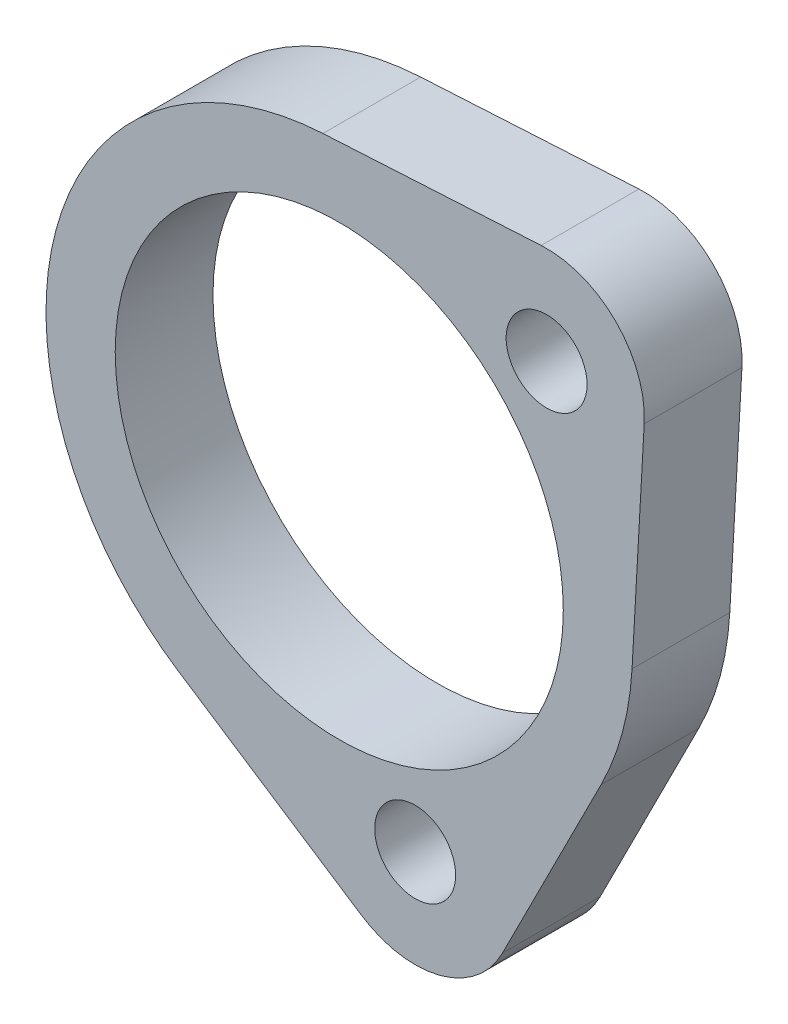
ISO-10303-21;
HEADER;
FILE_DESCRIPTION(('STEP AP214'),'2;1');
FILE_NAME('part.step','',(''),(''),'','','');
FILE_SCHEMA(('AUTOMOTIVE_DESIGN { 1 0 10303 214 1 1 1 1 }'));
ENDSEC;
DATA;
#1=APPLICATION_CONTEXT('core data for automotive mechanical design processes');
#2=APPLICATION_PROTOCOL_DEFINITION('international standard','automotive_design',2000,#1);
#3=PRODUCT_CONTEXT('',#1,'mechanical');
#4=PRODUCT('Part','Part','',(#3));
#5=PRODUCT_RELATED_PRODUCT_CATEGORY('part','',(#4));
#6=PRODUCT_DEFINITION_FORMATION('','',#4);
#7=PRODUCT_DEFINITION_CONTEXT('part definition',#1,'design');
#8=PRODUCT_DEFINITION('design','',#6,#7);
#9=PRODUCT_DEFINITION_SHAPE('','',#8);
#10=(LENGTH_UNIT() NAMED_UNIT(*) SI_UNIT(.MILLI.,.METRE.));
#11=(NAMED_UNIT(*) PLANE_ANGLE_UNIT() SI_UNIT($,.RADIAN.));
#12=(NAMED_UNIT(*) SI_UNIT($,.STERADIAN.) SOLID_ANGLE_UNIT());
#13=UNCERTAINTY_MEASURE_WITH_UNIT(LENGTH_MEASURE(1.E-05),#10,'distance_accuracy_value','');
#14=(GEOMETRIC_REPRESENTATION_CONTEXT(3) GLOBAL_UNCERTAINTY_ASSIGNED_CONTEXT((#13)) GLOBAL_UNIT_ASSIGNED_CONTEXT((#10,
#11,#12)) REPRESENTATION_CONTEXT('',''));
#15=CARTESIAN_POINT('',(0.,0.,0.));
#16=DIRECTION('',(0.,0.,1.));
#17=DIRECTION('',(1.,0.,0.));
#18=AXIS2_PLACEMENT_3D('',#15,#16,#17);
#19=CARTESIAN_POINT('',(13.4703841816036,13.4703841816039,6.35));
#20=DIRECTION('',(0.,0.,1.));
#21=DIRECTION('',(1.,0.,0.));
#22=AXIS2_PLACEMENT_3D('',#19,#20,#21);
#23=PLANE('',#22);
#24=CARTESIAN_POINT('',(4.93050280920324,-18.4008869908067,6.35));
#25=DIRECTION('',(0.,0.,1.));
#26=DIRECTION('',(1.,0.,0.));
#27=AXIS2_PLACEMENT_3D('',#24,#25,#26);
#28=CIRCLE('',#27,2.6289);
#29=CARTESIAN_POINT('',(7.55940280920324,-18.4008869908067,6.35));
#30=VERTEX_POINT('',#29);
#31=EDGE_CURVE('E182',#30,#30,#28,.T.);
#32=ORIENTED_EDGE('',*,*,#31,.F.);
#33=EDGE_LOOP('',(#32));
#34=FACE_BOUND('',#33,.T.);
#35=CARTESIAN_POINT('',(13.4703841816036,13.4703841816039,6.35));
#36=DIRECTION('',(0.,0.,1.));
#37=DIRECTION('',(1.,0.,0.));
#38=AXIS2_PLACEMENT_3D('',#35,#36,#37);
#39=CIRCLE('',#38,6.35);
#40=CARTESIAN_POINT('',(19.8105467456382,13.1170590316154,6.35));
#41=VERTEX_POINT('',#40);
#42=CARTESIAN_POINT('',(13.1170590316151,19.8105467456384,6.35));
#43=VERTEX_POINT('',#42);
#44=EDGE_CURVE('E145',#41,#43,#39,.T.);
#45=ORIENTED_EDGE('',*,*,#44,.T.);
#46=DIRECTION('',(-0.998450797485761,-0.055641755903707,0.));
#47=VECTOR('',#46,1.);
#48=CARTESIAN_POINT('',(-1.05997544996563,19.0204876921038,6.35));
#49=LINE('',#48,#47);
#50=CARTESIAN_POINT('',(-1.05997544996563,19.0204876921037,6.35));
#51=VERTEX_POINT('',#50);
#52=EDGE_CURVE('E93',#43,#51,#49,.T.);
#53=ORIENTED_EDGE('',*,*,#52,.T.);
#54=CARTESIAN_POINT('',(0.,0.,6.35));
#55=DIRECTION('',(0.,0.,1.));
#56=DIRECTION('',(1.,0.,0.));
#57=AXIS2_PLACEMENT_3D('',#54,#55,#56);
#58=CIRCLE('',#57,19.05);
#59=CARTESIAN_POINT('',(-10.4282095131096,-15.9422378087485,6.35));
#60=VERTEX_POINT('',#59);
#61=EDGE_CURVE('E160',#51,#60,#58,.T.);
#62=ORIENTED_EDGE('',*,*,#61,.T.);
#63=DIRECTION('',(0.836862877099659,-0.547412572866646,0.));
#64=VECTOR('',#63,1.);
#65=CARTESIAN_POINT('',(-10.4282095131096,-15.9422378087485,6.35));
#66=LINE('',#65,#64);
#67=CARTESIAN_POINT('',(1.45443297150005,-23.7149662603895,6.35));
#68=VERTEX_POINT('',#67);
#69=EDGE_CURVE('E173',#60,#68,#66,.T.);
#70=ORIENTED_EDGE('',*,*,#69,.T.);
#71=CARTESIAN_POINT('',(4.93050280920324,-18.4008869908067,6.35));
#72=DIRECTION('',(0.,0.,1.));
#73=DIRECTION('',(-1.,0.,0.));
#74=AXIS2_PLACEMENT_3D('',#71,#72,#73);
#75=CIRCLE('',#74,6.34999999999999);
#76=CARTESIAN_POINT('',(10.5979072287745,-21.2649797171379,6.35));
#77=VERTEX_POINT('',#76);
#78=EDGE_CURVE('E112',#68,#77,#75,.T.);
#79=ORIENTED_EDGE('',*,*,#78,.T.);
#80=DIRECTION('',(0.451038224619094,0.892504633003356,0.));
#81=VECTOR('',#80,1.);
#82=CARTESIAN_POINT('',(10.5979072287745,-21.2649797171379,6.35));
#83=LINE('',#82,#81);
#84=CARTESIAN_POINT('',(17.0022132587139,-8.59227817899376,6.35));
#85=VERTEX_POINT('',#84);
#86=EDGE_CURVE('E106',#77,#85,#83,.T.);
#87=ORIENTED_EDGE('',*,*,#86,.T.);
#88=CARTESIAN_POINT('',(0.,0.,6.35));
#89=DIRECTION('',(0.,0.,1.));
#90=DIRECTION('',(1.,0.,0.));
#91=AXIS2_PLACEMENT_3D('',#88,#89,#90);
#92=CIRCLE('',#91,19.05);
#93=CARTESIAN_POINT('',(19.0204876921038,-1.05997544996527,6.35));
#94=VERTEX_POINT('',#93);
#95=EDGE_CURVE('E110',#85,#94,#92,.T.);
#96=ORIENTED_EDGE('',*,*,#95,.T.);
#97=DIRECTION('',(0.0556417559036886,0.998450797485762,0.));
#98=VECTOR('',#97,1.);
#99=CARTESIAN_POINT('',(19.0204876921038,-1.05997544996527,6.35));
#100=LINE('',#99,#98);
#101=EDGE_CURVE('E50',#94,#41,#100,.T.);
#102=ORIENTED_EDGE('',*,*,#101,.T.);
#103=EDGE_LOOP('',(#45,#53,#62,#70,#79,#87,#96,#102));
#104=FACE_BOUND('',#103,.T.);
#105=CARTESIAN_POINT('',(0.,0.,6.35));
#106=DIRECTION('',(0.,0.,1.));
#107=DIRECTION('',(1.,0.,0.));
#108=AXIS2_PLACEMENT_3D('',#105,#106,#107);
#109=CIRCLE('',#108,14.5542);
#110=CARTESIAN_POINT('',(14.5542,0.,6.35));
#111=VERTEX_POINT('',#110);
#112=EDGE_CURVE('E134',#111,#111,#109,.T.);
#113=ORIENTED_EDGE('',*,*,#112,.F.);
#114=EDGE_LOOP('',(#113));
#115=FACE_BOUND('',#114,.T.);
#116=CARTESIAN_POINT('',(13.4703841816036,13.4703841816039,6.35));
#117=DIRECTION('',(0.,0.,1.));
#118=DIRECTION('',(1.,0.,0.));
#119=AXIS2_PLACEMENT_3D('',#116,#117,#118);
#120=CIRCLE('',#119,2.6289);
#121=CARTESIAN_POINT('',(16.0992841816036,13.4703841816039,6.35));
#122=VERTEX_POINT('',#121);
#123=EDGE_CURVE('E188',#122,#122,#120,.T.);
#124=ORIENTED_EDGE('',*,*,#123,.F.);
#125=EDGE_LOOP('',(#124));
#126=FACE_BOUND('',#125,.T.);
#127=ADVANCED_FACE('F33',(#34,#104,#115,#126),#23,.T.);
#128=CARTESIAN_POINT('',(13.4703841816036,13.4703841816039,0.));
#129=DIRECTION('',(0.,0.,1.));
#130=DIRECTION('',(1.,0.,0.));
#131=AXIS2_PLACEMENT_3D('',#128,#129,#130);
#132=PLANE('',#131);
#133=CARTESIAN_POINT('',(13.4703841816036,13.4703841816039,0.));
#134=DIRECTION('',(0.,0.,1.));
#135=DIRECTION('',(1.,0.,0.));
#136=AXIS2_PLACEMENT_3D('',#133,#134,#135);
#137=CIRCLE('',#136,6.35);
#138=CARTESIAN_POINT('',(19.8105467456382,13.1170590316154,0.));
#139=VERTEX_POINT('',#138);
#140=CARTESIAN_POINT('',(13.1170590316151,19.8105467456384,0.));
#141=VERTEX_POINT('',#140);
#142=EDGE_CURVE('E130',#139,#141,#137,.T.);
#143=ORIENTED_EDGE('',*,*,#142,.F.);
#144=DIRECTION('',(0.0556417559036886,0.998450797485762,0.));
#145=VECTOR('',#144,1.);
#146=CARTESIAN_POINT('',(19.0204876921038,-1.05997544996527,0.));
#147=LINE('',#146,#145);
#148=CARTESIAN_POINT('',(19.0204876921038,-1.05997544996527,0.));
#149=VERTEX_POINT('',#148);
#150=EDGE_CURVE('E85',#149,#139,#147,.T.);
#151=ORIENTED_EDGE('',*,*,#150,.F.);
#152=CARTESIAN_POINT('',(0.,0.,0.));
#153=DIRECTION('',(0.,0.,1.));
#154=DIRECTION('',(1.,0.,0.));
#155=AXIS2_PLACEMENT_3D('',#152,#153,#154);
#156=CIRCLE('',#155,19.05);
#157=CARTESIAN_POINT('',(17.0022132587139,-8.59227817899376,0.));
#158=VERTEX_POINT('',#157);
#159=EDGE_CURVE('E79',#158,#149,#156,.T.);
#160=ORIENTED_EDGE('',*,*,#159,.F.);
#161=DIRECTION('',(0.451038224619094,0.892504633003356,0.));
#162=VECTOR('',#161,1.);
#163=CARTESIAN_POINT('',(10.5979072287745,-21.2649797171379,0.));
#164=LINE('',#163,#162);
#165=CARTESIAN_POINT('',(10.5979072287745,-21.2649797171379,0.));
#166=VERTEX_POINT('',#165);
#167=EDGE_CURVE('E120',#166,#158,#164,.T.);
#168=ORIENTED_EDGE('',*,*,#167,.F.);
#169=CARTESIAN_POINT('',(4.93050280920324,-18.4008869908067,0.));
#170=DIRECTION('',(0.,0.,1.));
#171=DIRECTION('',(-1.,0.,0.));
#172=AXIS2_PLACEMENT_3D('',#169,#170,#171);
#173=CIRCLE('',#172,6.34999999999999);
#174=CARTESIAN_POINT('',(1.45443297150005,-23.7149662603895,0.));
#175=VERTEX_POINT('',#174);
#176=EDGE_CURVE('E140',#175,#166,#173,.T.);
#177=ORIENTED_EDGE('',*,*,#176,.F.);
#178=DIRECTION('',(0.836862877099659,-0.547412572866646,0.));
#179=VECTOR('',#178,1.);
#180=CARTESIAN_POINT('',(-10.4282095131096,-15.9422378087485,0.));
#181=LINE('',#180,#179);
#182=CARTESIAN_POINT('',(-10.4282095131096,-15.9422378087485,0.));
#183=VERTEX_POINT('',#182);
#184=EDGE_CURVE('E138',#183,#175,#181,.T.);
#185=ORIENTED_EDGE('',*,*,#184,.F.);
#186=CARTESIAN_POINT('',(0.,0.,0.));
#187=DIRECTION('',(0.,0.,1.));
#188=DIRECTION('',(1.,0.,0.));
#189=AXIS2_PLACEMENT_3D('',#186,#187,#188);
#190=CIRCLE('',#189,19.05);
#191=CARTESIAN_POINT('',(-1.05997544996563,19.0204876921037,0.));
#192=VERTEX_POINT('',#191);
#193=EDGE_CURVE('E136',#192,#183,#190,.T.);
#194=ORIENTED_EDGE('',*,*,#193,.F.);
#195=DIRECTION('',(-0.998450797485761,-0.055641755903707,0.));
#196=VECTOR('',#195,1.);
#197=CARTESIAN_POINT('',(-1.05997544996563,19.0204876921038,0.));
#198=LINE('',#197,#196);
#199=EDGE_CURVE('E133',#141,#192,#198,.T.);
#200=ORIENTED_EDGE('',*,*,#199,.F.);
#201=EDGE_LOOP('',(#143,#151,#160,#168,#177,#185,#194,#200));
#202=FACE_BOUND('',#201,.T.);
#203=CARTESIAN_POINT('',(0.,0.,0.));
#204=DIRECTION('',(0.,0.,1.));
#205=DIRECTION('',(1.,0.,0.));
#206=AXIS2_PLACEMENT_3D('',#203,#204,#205);
#207=CIRCLE('',#206,14.5542);
#208=CARTESIAN_POINT('',(14.5542,0.,0.));
#209=VERTEX_POINT('',#208);
#210=EDGE_CURVE('E179',#209,#209,#207,.T.);
#211=ORIENTED_EDGE('',*,*,#210,.T.);
#212=EDGE_LOOP('',(#211));
#213=FACE_BOUND('',#212,.T.);
#214=CARTESIAN_POINT('',(4.93050280920324,-18.4008869908067,0.));
#215=DIRECTION('',(0.,0.,1.));
#216=DIRECTION('',(1.,0.,0.));
#217=AXIS2_PLACEMENT_3D('',#214,#215,#216);
#218=CIRCLE('',#217,2.6289);
#219=CARTESIAN_POINT('',(7.55940280920324,-18.4008869908067,0.));
#220=VERTEX_POINT('',#219);
#221=EDGE_CURVE('E185',#220,#220,#218,.T.);
#222=ORIENTED_EDGE('',*,*,#221,.T.);
#223=EDGE_LOOP('',(#222));
#224=FACE_BOUND('',#223,.T.);
#225=CARTESIAN_POINT('',(13.4703841816036,13.4703841816039,0.));
#226=DIRECTION('',(0.,0.,1.));
#227=DIRECTION('',(1.,0.,0.));
#228=AXIS2_PLACEMENT_3D('',#225,#226,#227);
#229=CIRCLE('',#228,2.6289);
#230=CARTESIAN_POINT('',(16.0992841816036,13.4703841816039,0.));
#231=VERTEX_POINT('',#230);
#232=EDGE_CURVE('E191',#231,#231,#229,.T.);
#233=ORIENTED_EDGE('',*,*,#232,.T.);
#234=EDGE_LOOP('',(#233));
#235=FACE_BOUND('',#234,.T.);
#236=ADVANCED_FACE('F164',(#202,#213,#224,#235),#132,.F.);
#237=CARTESIAN_POINT('',(13.4703841816036,13.4703841816039,6.35));
#238=DIRECTION('',(0.,0.,-1.));
#239=DIRECTION('',(-1.,0.,0.));
#240=AXIS2_PLACEMENT_3D('',#237,#238,#239);
#241=CYLINDRICAL_SURFACE('',#240,6.35);
#242=ORIENTED_EDGE('',*,*,#142,.T.);
#243=DIRECTION('',(0.,0.,-1.));
#244=VECTOR('',#243,1.);
#245=CARTESIAN_POINT('',(13.1170590316151,19.8105467456384,6.35));
#246=LINE('',#245,#244);
#247=EDGE_CURVE('E11',#43,#141,#246,.T.);
#248=ORIENTED_EDGE('',*,*,#247,.F.);
#249=ORIENTED_EDGE('',*,*,#44,.F.);
#250=DIRECTION('',(0.,0.,-1.));
#251=VECTOR('',#250,1.);
#252=CARTESIAN_POINT('',(19.8105467456382,13.1170590316154,6.35));
#253=LINE('',#252,#251);
#254=EDGE_CURVE('E126',#41,#139,#253,.T.);
#255=ORIENTED_EDGE('',*,*,#254,.T.);
#256=EDGE_LOOP('',(#242,#248,#249,#255));
#257=FACE_BOUND('',#256,.T.);
#258=ADVANCED_FACE('F35',(#257),#241,.T.);
#259=CARTESIAN_POINT('',(-1.05997544996563,19.0204876921038,6.35));
#260=DIRECTION('',(0.055641755903707,-0.998450797485761,0.));
#261=DIRECTION('',(0.998450797485761,0.055641755903707,0.));
#262=AXIS2_PLACEMENT_3D('',#259,#260,#261);
#263=PLANE('',#262);
#264=ORIENTED_EDGE('',*,*,#199,.T.);
#265=DIRECTION('',(0.,0.,-1.));
#266=VECTOR('',#265,1.);
#267=CARTESIAN_POINT('',(-1.05997544996563,19.0204876921037,6.35));
#268=LINE('',#267,#266);
#269=EDGE_CURVE('E42',#51,#192,#268,.T.);
#270=ORIENTED_EDGE('',*,*,#269,.F.);
#271=ORIENTED_EDGE('',*,*,#52,.F.);
#272=ORIENTED_EDGE('',*,*,#247,.T.);
#273=EDGE_LOOP('',(#264,#270,#271,#272));
#274=FACE_BOUND('',#273,.T.);
#275=ADVANCED_FACE('F224',(#274),#263,.F.);
#276=CARTESIAN_POINT('',(0.,0.,6.35));
#277=DIRECTION('',(0.,0.,-1.));
#278=DIRECTION('',(-1.,0.,0.));
#279=AXIS2_PLACEMENT_3D('',#276,#277,#278);
#280=CYLINDRICAL_SURFACE('',#279,19.05);
#281=ORIENTED_EDGE('',*,*,#193,.T.);
#282=DIRECTION('',(0.,0.,-1.));
#283=VECTOR('',#282,1.);
#284=CARTESIAN_POINT('',(-10.4282095131096,-15.9422378087485,6.35));
#285=LINE('',#284,#283);
#286=EDGE_CURVE('E152',#60,#183,#285,.T.);
#287=ORIENTED_EDGE('',*,*,#286,.F.);
#288=ORIENTED_EDGE('',*,*,#61,.F.);
#289=ORIENTED_EDGE('',*,*,#269,.T.);
#290=EDGE_LOOP('',(#281,#287,#288,#289));
#291=FACE_BOUND('',#290,.T.);
#292=ADVANCED_FACE('F158',(#291),#280,.T.);
#293=CARTESIAN_POINT('',(-10.4282095131096,-15.9422378087485,6.35));
#294=DIRECTION('',(0.547412572866646,0.836862877099659,0.));
#295=DIRECTION('',(-0.836862877099659,0.547412572866646,0.));
#296=AXIS2_PLACEMENT_3D('',#293,#294,#295);
#297=PLANE('',#296);
#298=ORIENTED_EDGE('',*,*,#184,.T.);
#299=DIRECTION('',(0.,0.,-1.));
#300=VECTOR('',#299,1.);
#301=CARTESIAN_POINT('',(1.45443297150005,-23.7149662603895,6.35));
#302=LINE('',#301,#300);
#303=EDGE_CURVE('E149',#68,#175,#302,.T.);
#304=ORIENTED_EDGE('',*,*,#303,.F.);
#305=ORIENTED_EDGE('',*,*,#69,.F.);
#306=ORIENTED_EDGE('',*,*,#286,.T.);
#307=EDGE_LOOP('',(#298,#304,#305,#306));
#308=FACE_BOUND('',#307,.T.);
#309=ADVANCED_FACE('F169',(#308),#297,.F.);
#310=CARTESIAN_POINT('',(4.93050280920324,-18.4008869908067,6.35));
#311=DIRECTION('',(0.,0.,-1.));
#312=DIRECTION('',(-1.,0.,0.));
#313=AXIS2_PLACEMENT_3D('',#310,#311,#312);
#314=CYLINDRICAL_SURFACE('',#313,6.34999999999999);
#315=ORIENTED_EDGE('',*,*,#176,.T.);
#316=DIRECTION('',(0.,0.,-1.));
#317=VECTOR('',#316,1.);
#318=CARTESIAN_POINT('',(10.5979072287745,-21.2649797171379,6.35));
#319=LINE('',#318,#317);
#320=EDGE_CURVE('E121',#77,#166,#319,.T.);
#321=ORIENTED_EDGE('',*,*,#320,.F.);
#322=ORIENTED_EDGE('',*,*,#78,.F.);
#323=ORIENTED_EDGE('',*,*,#303,.T.);
#324=EDGE_LOOP('',(#315,#321,#322,#323));
#325=FACE_BOUND('',#324,.T.);
#326=ADVANCED_FACE('F172',(#325),#314,.T.);
#327=CARTESIAN_POINT('',(10.5979072287745,-21.2649797171379,6.35));
#328=DIRECTION('',(-0.892504633003356,0.451038224619094,0.));
#329=DIRECTION('',(-0.451038224619094,-0.892504633003356,0.));
#330=AXIS2_PLACEMENT_3D('',#327,#328,#329);
#331=PLANE('',#330);
#332=ORIENTED_EDGE('',*,*,#167,.T.);
#333=DIRECTION('',(0.,0.,-1.));
#334=VECTOR('',#333,1.);
#335=CARTESIAN_POINT('',(17.0022132587139,-8.59227817899376,6.35));
#336=LINE('',#335,#334);
#337=EDGE_CURVE('E117',#85,#158,#336,.T.);
#338=ORIENTED_EDGE('',*,*,#337,.F.);
#339=ORIENTED_EDGE('',*,*,#86,.F.);
#340=ORIENTED_EDGE('',*,*,#320,.T.);
#341=EDGE_LOOP('',(#332,#338,#339,#340));
#342=FACE_BOUND('',#341,.T.);
#343=ADVANCED_FACE('F118',(#342),#331,.F.);
#344=CARTESIAN_POINT('',(0.,0.,6.35));
#345=DIRECTION('',(0.,0.,-1.));
#346=DIRECTION('',(-1.,0.,0.));
#347=AXIS2_PLACEMENT_3D('',#344,#345,#346);
#348=CYLINDRICAL_SURFACE('',#347,19.05);
#349=ORIENTED_EDGE('',*,*,#159,.T.);
#350=DIRECTION('',(0.,0.,-1.));
#351=VECTOR('',#350,1.);
#352=CARTESIAN_POINT('',(19.0204876921038,-1.05997544996527,6.35));
#353=LINE('',#352,#351);
#354=EDGE_CURVE('E122',#94,#149,#353,.T.);
#355=ORIENTED_EDGE('',*,*,#354,.F.);
#356=ORIENTED_EDGE('',*,*,#95,.F.);
#357=ORIENTED_EDGE('',*,*,#337,.T.);
#358=EDGE_LOOP('',(#349,#355,#356,#357));
#359=FACE_BOUND('',#358,.T.);
#360=ADVANCED_FACE('F124',(#359),#348,.T.);
#361=CARTESIAN_POINT('',(19.0204876921038,-1.05997544996527,6.35));
#362=DIRECTION('',(-0.998450797485762,0.0556417559036886,0.));
#363=DIRECTION('',(-0.0556417559036886,-0.998450797485762,0.));
#364=AXIS2_PLACEMENT_3D('',#361,#362,#363);
#365=PLANE('',#364);
#366=ORIENTED_EDGE('',*,*,#150,.T.);
#367=ORIENTED_EDGE('',*,*,#254,.F.);
#368=ORIENTED_EDGE('',*,*,#101,.F.);
#369=ORIENTED_EDGE('',*,*,#354,.T.);
#370=EDGE_LOOP('',(#366,#367,#368,#369));
#371=FACE_BOUND('',#370,.T.);
#372=ADVANCED_FACE('F212',(#371),#365,.F.);
#373=CARTESIAN_POINT('',(0.,0.,6.35));
#374=DIRECTION('',(0.,0.,-1.));
#375=DIRECTION('',(-1.,0.,0.));
#376=AXIS2_PLACEMENT_3D('',#373,#374,#375);
#377=CYLINDRICAL_SURFACE('',#376,14.5542);
#378=ORIENTED_EDGE('',*,*,#112,.T.);
#379=EDGE_LOOP('',(#378));
#380=FACE_BOUND('',#379,.T.);
#381=ORIENTED_EDGE('',*,*,#210,.F.);
#382=EDGE_LOOP('',(#381));
#383=FACE_BOUND('',#382,.T.);
#384=ADVANCED_FACE('F209',(#380,#383),#377,.F.);
#385=CARTESIAN_POINT('',(4.93050280920324,-18.4008869908067,6.35));
#386=DIRECTION('',(0.,0.,-1.));
#387=DIRECTION('',(-1.,0.,0.));
#388=AXIS2_PLACEMENT_3D('',#385,#386,#387);
#389=CYLINDRICAL_SURFACE('',#388,2.6289);
#390=ORIENTED_EDGE('',*,*,#31,.T.);
#391=EDGE_LOOP('',(#390));
#392=FACE_BOUND('',#391,.T.);
#393=ORIENTED_EDGE('',*,*,#221,.F.);
#394=EDGE_LOOP('',(#393));
#395=FACE_BOUND('',#394,.T.);
#396=ADVANCED_FACE('F288',(#392,#395),#389,.F.);
#397=CARTESIAN_POINT('',(13.4703841816036,13.4703841816039,6.35));
#398=DIRECTION('',(0.,0.,-1.));
#399=DIRECTION('',(-1.,0.,0.));
#400=AXIS2_PLACEMENT_3D('',#397,#398,#399);
#401=CYLINDRICAL_SURFACE('',#400,2.6289);
#402=ORIENTED_EDGE('',*,*,#123,.T.);
#403=EDGE_LOOP('',(#402));
#404=FACE_BOUND('',#403,.T.);
#405=ORIENTED_EDGE('',*,*,#232,.F.);
#406=EDGE_LOOP('',(#405));
#407=FACE_BOUND('',#406,.T.);
#408=ADVANCED_FACE('F197',(#404,#407),#401,.F.);
#409=CLOSED_SHELL('',(#127,#236,#258,#275,#292,#309,#326,#343,#360,#372,#384,#396,#408));
#410=MANIFOLD_SOLID_BREP('B2',#409);
#411=ADVANCED_BREP_SHAPE_REPRESENTATION('',(#18,#410),#14);
#412=SHAPE_DEFINITION_REPRESENTATION(#9,#411);
ENDSEC;
END-ISO-10303-21;
